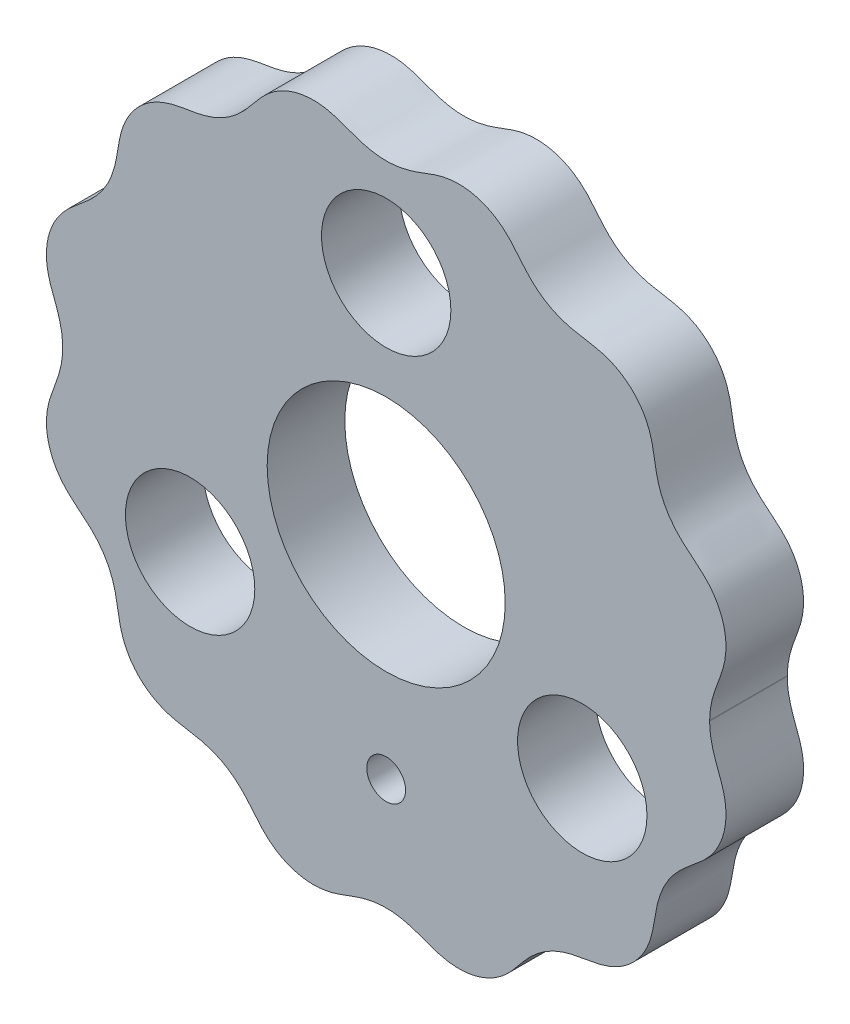
ISO-10303-21;
HEADER;
FILE_DESCRIPTION(('STEP AP214'),'2;1');
FILE_NAME('part.step','',(''),(''),'','','');
FILE_SCHEMA(('AUTOMOTIVE_DESIGN { 1 0 10303 214 1 1 1 1 }'));
ENDSEC;
DATA;
#1=APPLICATION_CONTEXT('core data for automotive mechanical design processes');
#2=APPLICATION_PROTOCOL_DEFINITION('international standard','automotive_design',2000,#1);
#3=PRODUCT_CONTEXT('',#1,'mechanical');
#4=PRODUCT('Part','Part','',(#3));
#5=PRODUCT_RELATED_PRODUCT_CATEGORY('part','',(#4));
#6=PRODUCT_DEFINITION_FORMATION('','',#4);
#7=PRODUCT_DEFINITION_CONTEXT('part definition',#1,'design');
#8=PRODUCT_DEFINITION('design','',#6,#7);
#9=PRODUCT_DEFINITION_SHAPE('','',#8);
#10=(LENGTH_UNIT() NAMED_UNIT(*) SI_UNIT(.MILLI.,.METRE.));
#11=(NAMED_UNIT(*) PLANE_ANGLE_UNIT() SI_UNIT($,.RADIAN.));
#12=(NAMED_UNIT(*) SI_UNIT($,.STERADIAN.) SOLID_ANGLE_UNIT());
#13=UNCERTAINTY_MEASURE_WITH_UNIT(LENGTH_MEASURE(1.E-05),#10,'distance_accuracy_value','');
#14=(GEOMETRIC_REPRESENTATION_CONTEXT(3) GLOBAL_UNCERTAINTY_ASSIGNED_CONTEXT((#13)) GLOBAL_UNIT_ASSIGNED_CONTEXT((#10,
#11,#12)) REPRESENTATION_CONTEXT('',''));
#15=CARTESIAN_POINT('',(0.,0.,0.));
#16=DIRECTION('',(0.,0.,1.));
#17=DIRECTION('',(1.,0.,0.));
#18=AXIS2_PLACEMENT_3D('',#15,#16,#17);
#19=CARTESIAN_POINT('',(-25.0000232097076,-0.0248577986676224,6.));
#20=DIRECTION('',(0.,0.,-1.));
#21=DIRECTION('',(-1.,0.,0.));
#22=AXIS2_PLACEMENT_3D('',#19,#20,#21);
#23=PLANE('',#22);
#24=CARTESIAN_POINT('',(0.,-16.3832589133777,6.));
#25=DIRECTION('',(0.,0.,-1.));
#26=DIRECTION('',(-1.,0.,0.));
#27=AXIS2_PLACEMENT_3D('',#24,#25,#26);
#28=CIRCLE('',#27,1.5);
#29=CARTESIAN_POINT('',(-1.5,-16.3832589133777,6.));
#30=VERTEX_POINT('',#29);
#31=EDGE_CURVE('E149',#30,#30,#28,.T.);
#32=ORIENTED_EDGE('',*,*,#31,.T.);
#33=EDGE_LOOP('',(#32));
#34=FACE_BOUND('',#33,.T.);
#35=CARTESIAN_POINT('',(25.,0.,6.));
#36=CARTESIAN_POINT('',(25.0002031752634,0.049701947483604,6.));
#37=B_SPLINE_CURVE_WITH_KNOTS('',1,(#35,#36),.UNSPECIFIED.,.F.,.F.,(2,2),(0.,1.),.UNSPECIFIED.);
#38=CARTESIAN_POINT('',(25.,0.,6.));
#39=VERTEX_POINT('',#38);
#40=CARTESIAN_POINT('',(25.0002031752634,0.049701947483604,6.));
#41=VERTEX_POINT('',#40);
#42=EDGE_CURVE('E78',#39,#41,#37,.T.);
#43=ORIENTED_EDGE('',*,*,#42,.T.);
#44=CARTESIAN_POINT('',(25.0002031752634,0.049701947483604,6.));
#45=CARTESIAN_POINT('',(25.0004308029821,0.0775440355542,6.));
#46=CARTESIAN_POINT('',(25.0013589498389,0.133217808747836,6.));
#47=CARTESIAN_POINT('',(25.0052678853576,0.264321242683308,6.));
#48=CARTESIAN_POINT('',(25.0169608644288,0.48250430067262,6.));
#49=CARTESIAN_POINT('',(25.0385059182462,0.70465122014413,6.));
#50=CARTESIAN_POINT('',(25.0741191224221,0.965148365334424,6.));
#51=CARTESIAN_POINT('',(25.1202578992177,1.224415288328,6.));
#52=CARTESIAN_POINT('',(25.1763613388595,1.48087377439008,6.));
#53=CARTESIAN_POINT('',(25.2417218488057,1.73543576113443,6.));
#54=CARTESIAN_POINT('',(25.3338607648862,2.05070631367887,6.));
#55=CARTESIAN_POINT('',(25.458833671547,2.42450299248366,6.));
#56=CARTESIAN_POINT('',(25.619629464377,2.8553270127947,6.));
#57=CARTESIAN_POINT('',(25.807904949584,3.34569526181193,6.));
#58=CARTESIAN_POINT('',(25.9672323912442,3.80231614672646,6.));
#59=CARTESIAN_POINT('',(26.0881089968424,4.22663091276651,6.));
#60=CARTESIAN_POINT('',(26.1914394354639,4.70429623522627,6.));
#61=CARTESIAN_POINT('',(26.284792989899,5.41228832652757,6.));
#62=CARTESIAN_POINT('',(26.262511443744,6.4138480406696,6.));
#63=CARTESIAN_POINT('',(25.9409426877914,7.66207714145739,6.));
#64=CARTESIAN_POINT('',(25.2467966467963,8.85795173550189,6.));
#65=CARTESIAN_POINT('',(24.3436846993853,9.76955190457595,6.));
#66=CARTESIAN_POINT('',(23.4156486044098,10.484119509653,6.));
#67=CARTESIAN_POINT('',(22.6100709293762,11.1924733788569,6.));
#68=CARTESIAN_POINT('',(21.9154014187569,12.0128419880505,6.));
#69=CARTESIAN_POINT('',(21.3746687710916,12.943487437276,6.));
#70=CARTESIAN_POINT('',(21.0065603301337,13.9534869995405,6.));
#71=CARTESIAN_POINT('',(20.7917871154137,15.0047427288731,6.));
#72=CARTESIAN_POINT('',(20.6379047111279,16.1656909527777,6.));
#73=CARTESIAN_POINT('',(20.3071808169387,17.4054038528733,6.));
#74=CARTESIAN_POINT('',(19.6220896229016,18.6152349308986,6.));
#75=CARTESIAN_POINT('',(18.6971203126412,19.5302350604708,6.));
#76=CARTESIAN_POINT('',(17.7515763341302,20.1059414667156,6.));
#77=CARTESIAN_POINT('',(16.8189538381598,20.4660073005702,6.));
#78=CARTESIAN_POINT('',(15.9373402603937,20.6681171818277,6.));
#79=CARTESIAN_POINT('',(14.959093015374,20.799215780305,6.));
#80=CARTESIAN_POINT('',(13.9050809626805,21.0193307012289,6.));
#81=CARTESIAN_POINT('',(12.8989692163994,21.396054985324,6.));
#82=CARTESIAN_POINT('',(11.9779735266036,21.9410220374457,6.));
#83=CARTESIAN_POINT('',(11.1701057373892,22.6339793210062,6.));
#84=CARTESIAN_POINT('',(10.4740707739569,23.4291515649925,6.));
#85=CARTESIAN_POINT('',(9.77041704815124,24.3410303174548,6.));
#86=CARTESIAN_POINT('',(8.87788026677586,25.227310888559,6.));
#87=CARTESIAN_POINT('',(7.7020486010681,25.9226038117715,6.));
#88=CARTESIAN_POINT('',(6.29085555988615,26.3006923266119,6.));
#89=CARTESIAN_POINT('',(4.92490938273092,26.2863966030001,6.));
#90=CARTESIAN_POINT('',(3.70882720506166,25.9650638122916,6.));
#91=CARTESIAN_POINT('',(2.64351018252455,25.5271727519968,6.));
#92=CARTESIAN_POINT('',(1.64312745783005,25.1865822256271,6.));
#93=CARTESIAN_POINT('',(0.597006536244666,24.9904413030713,6.));
#94=CARTESIAN_POINT('',(-0.47308343493786,24.9790339612736,6.));
#95=CARTESIAN_POINT('',(-1.53275588650047,25.1558825059455,6.));
#96=CARTESIAN_POINT('',(-2.55560207970244,25.492296977168,6.));
#97=CARTESIAN_POINT('',(-3.46833934497676,25.8678840012778,6.));
#98=CARTESIAN_POINT('',(-4.33290584530746,26.133623194386,6.));
#99=CARTESIAN_POINT('',(-5.32062141951383,26.2880601849475,6.));
#100=CARTESIAN_POINT('',(-6.42733790436494,26.2621973319436,6.));
#101=CARTESIAN_POINT('',(-7.6858688459378,25.932204762174,6.));
#102=CARTESIAN_POINT('',(-8.88405221815833,25.2269417218865,6.));
#103=CARTESIAN_POINT('',(-9.79028218155391,24.3186406944825,6.));
#104=CARTESIAN_POINT('',(-10.5040082869553,23.3901624390499,6.));
#105=CARTESIAN_POINT('',(-11.2156781347917,22.5871666195559,6.));
#106=CARTESIAN_POINT('',(-12.0394746157634,21.8965551364855,6.));
#107=CARTESIAN_POINT('',(-12.9731479381141,21.3610262292244,6.));
#108=CARTESIAN_POINT('',(-13.9848871216895,20.9979048824743,6.));
#109=CARTESIAN_POINT('',(-15.0368297566396,20.7873447689302,6.));
#110=CARTESIAN_POINT('',(-16.1976222288373,20.6324003972841,6.));
#111=CARTESIAN_POINT('',(-17.43583942896,20.2946140334418,6.));
#112=CARTESIAN_POINT('',(-18.4836718031551,19.6922779132858,6.));
#113=CARTESIAN_POINT('',(-19.3001496260399,18.9287579936141,6.));
#114=CARTESIAN_POINT('',(-19.9569019400926,18.0284413485263,6.));
#115=CARTESIAN_POINT('',(-20.3956228737666,17.1161104301816,6.));
#116=CARTESIAN_POINT('',(-20.6530452676583,16.0602863357028,6.));
#117=CARTESIAN_POINT('',(-20.8061351462569,14.9146022110265,6.));
#118=CARTESIAN_POINT('',(-21.0267189246062,13.8865221765981,6.));
#119=CARTESIAN_POINT('',(-21.3977475752367,12.8977489520371,6.));
#120=CARTESIAN_POINT('',(-21.9368965677596,11.9842924543769,6.));
#121=CARTESIAN_POINT('',(-22.6269932301173,11.176369600017,6.));
#122=CARTESIAN_POINT('',(-23.4270223990997,10.4755785196582,6.));
#123=CARTESIAN_POINT('',(-24.3450438403366,9.76755733882921,6.));
#124=CARTESIAN_POINT('',(-25.2377013940964,8.86663734596778,6.));
#125=CARTESIAN_POINT('',(-25.9335644549066,7.67844164741142,6.));
#126=CARTESIAN_POINT('',(-26.2610931106782,6.43001326971601,6.));
#127=CARTESIAN_POINT('',(-26.2885152218496,5.32858356774412,6.));
#128=CARTESIAN_POINT('',(-26.1354550635467,4.34059115997797,6.));
#129=CARTESIAN_POINT('',(-25.8707364066922,3.47572040001724,6.));
#130=CARTESIAN_POINT('',(-25.4952059309911,2.56292781452694,6.));
#131=CARTESIAN_POINT('',(-25.157831342755,1.54045458684821,6.));
#132=CARTESIAN_POINT('',(-24.9796766478588,0.481005827793855,6.));
#133=CARTESIAN_POINT('',(-24.9896445598273,-0.589100982082312,6.));
#134=CARTESIAN_POINT('',(-25.1845260720633,-1.63546137962552,6.));
#135=CARTESIAN_POINT('',(-25.5242140207482,-2.63620601322623,6.));
#136=CARTESIAN_POINT('',(-25.9623216597714,-3.70140198241162,6.));
#137=CARTESIAN_POINT('',(-26.285367063799,-4.91697626625228,6.));
#138=CARTESIAN_POINT('',(-26.3016798158474,-6.28291040166162,6.));
#139=CARTESIAN_POINT('',(-25.9257099084613,-7.69466919566292,6.));
#140=CARTESIAN_POINT('',(-25.2321589722124,-8.87151757244903,6.));
#141=CARTESIAN_POINT('',(-24.3471119837177,-9.7653501872607,6.));
#142=CARTESIAN_POINT('',(-23.4353674871062,-10.4692298582723,6.));
#143=CARTESIAN_POINT('',(-22.6395983382936,-11.1645009343387,6.));
#144=CARTESIAN_POINT('',(-21.9456715794189,-11.9715360343762,6.));
#145=CARTESIAN_POINT('',(-21.3994695440305,-12.8917897274263,6.));
#146=CARTESIAN_POINT('',(-21.0214990457729,-13.8974500485877,6.));
#147=CARTESIAN_POINT('',(-20.8003680092921,-14.951283195106,6.));
#148=CARTESIAN_POINT('',(-20.6693257410411,-15.9295422426056,6.));
#149=CARTESIAN_POINT('',(-20.4682601839915,-16.8113528787841,6.));
#150=CARTESIAN_POINT('',(-20.1095054344532,-17.7444909566973,6.));
#151=CARTESIAN_POINT('',(-19.5352250693332,-18.6908790699779,6.));
#152=CARTESIAN_POINT('',(-18.6215891985111,-19.6172341961515,6.));
#153=CARTESIAN_POINT('',(-17.4127951277837,-20.3040962801588,6.));
#154=CARTESIAN_POINT('',(-16.1734934696653,-20.6366044147941,6.));
#155=CARTESIAN_POINT('',(-15.0125428588064,-20.7906810729801,6.));
#156=CARTESIAN_POINT('',(-13.9611505342109,-21.0044479566719,6.));
#157=CARTESIAN_POINT('',(-12.9506870477024,-21.3713236067917,6.));
#158=CARTESIAN_POINT('',(-12.0193496474329,-21.9108020955093,6.));
#159=CARTESIAN_POINT('',(-11.1980708136155,-22.604475082747,6.));
#160=CARTESIAN_POINT('',(-10.4890421759678,-23.4094433121762,6.));
#161=CARTESIAN_POINT('',(-9.77447284204153,-24.337578456278,6.));
#162=CARTESIAN_POINT('',(-8.86453555729236,-25.2419920847794,6.));
#163=CARTESIAN_POINT('',(-7.81941348054743,-25.850368790917,6.));
#164=CARTESIAN_POINT('',(-6.75111843693724,-26.1766735877724,6.));
#165=CARTESIAN_POINT('',(-5.82719566616261,-26.2778400488724,6.));
#166=CARTESIAN_POINT('',(-5.08414189054617,-26.2552250846514,6.));
#167=CARTESIAN_POINT('',(-4.27435701235898,-26.1193555304735,6.));
#168=CARTESIAN_POINT('',(-3.41922910418536,-25.84785235,6.));
#169=CARTESIAN_POINT('',(-2.52044947063853,-25.4794613328657,6.));
#170=CARTESIAN_POINT('',(-1.52096638794575,-25.1546359371525,6.));
#171=CARTESIAN_POINT('',(-0.478930933339679,-24.9807134806625,6.));
#172=CARTESIAN_POINT('',(0.581426655581783,-24.9891026430057,6.));
#173=CARTESIAN_POINT('',(1.62667227001988,-25.1817505783671,6.));
#174=CARTESIAN_POINT('',(2.63367400387672,-25.5229674346919,6.));
#175=CARTESIAN_POINT('',(3.70611560055771,-25.9645833223633,6.));
#176=CARTESIAN_POINT('',(4.9315827981852,-26.2884722321436,6.));
#177=CARTESIAN_POINT('',(6.30933785562294,-26.2998640826,6.));
#178=CARTESIAN_POINT('',(7.731407453562,-25.9116598464267,6.));
#179=CARTESIAN_POINT('',(8.91250207436252,-25.202295012769,6.));
#180=CARTESIAN_POINT('',(9.80386463625248,-24.3011583322881,6.));
#181=CARTESIAN_POINT('',(10.5105104864333,-23.3823768913158,6.));
#182=CARTESIAN_POINT('',(11.2172632854706,-22.586282659155,6.));
#183=CARTESIAN_POINT('',(12.2371189102909,-21.7311243612219,6.));
#184=CARTESIAN_POINT('',(13.4394027619243,-21.125853099715,6.));
#185=CARTESIAN_POINT('',(14.7399499082291,-20.8265445235791,6.));
#186=CARTESIAN_POINT('',(16.1514869182664,-20.6399940454572,6.));
#187=CARTESIAN_POINT('',(17.377311503242,-20.3162532662721,6.));
#188=CARTESIAN_POINT('',(18.5781785299062,-19.6481673968653,6.));
#189=CARTESIAN_POINT('',(19.6200814178526,-18.6143671567186,6.));
#190=CARTESIAN_POINT('',(20.2957900238015,-17.4235772032078,6.));
#191=CARTESIAN_POINT('',(20.6292296768879,-16.2106156715508,6.));
#192=CARTESIAN_POINT('',(20.7831522177232,-15.0690546129471,6.));
#193=CARTESIAN_POINT('',(20.9864743382032,-14.0322166930284,6.));
#194=CARTESIAN_POINT('',(21.3370872274826,-13.0271415620461,6.));
#195=CARTESIAN_POINT('',(21.8597723823047,-12.0935327250146,6.));
#196=CARTESIAN_POINT('',(22.5404514437567,-11.2620272553952,6.));
#197=CARTESIAN_POINT('',(23.2420347985814,-10.6335048558452,6.));
#198=CARTESIAN_POINT('',(23.8729241339272,-10.1328677537652,6.));
#199=CARTESIAN_POINT('',(24.559448753872,-9.54877519107727,6.));
#200=CARTESIAN_POINT('',(25.2509330394033,-8.82402404509227,6.));
#201=CARTESIAN_POINT('',(25.9005904677268,-7.75892757333974,6.));
#202=CARTESIAN_POINT('',(26.2488657418611,-6.509268079248,6.));
#203=CARTESIAN_POINT('',(26.2930130200272,-5.40057761661743,6.));
#204=CARTESIAN_POINT('',(26.1690820375023,-4.53635291845614,6.));
#205=CARTESIAN_POINT('',(26.0074616040383,-3.91960884313096,6.));
#206=CARTESIAN_POINT('',(25.837320411901,-3.42880771729377,6.));
#207=CARTESIAN_POINT('',(25.6953068903752,-3.05245073395512,6.));
#208=CARTESIAN_POINT('',(25.5527913461473,-2.67635693700375,6.));
#209=CARTESIAN_POINT('',(25.4376716689992,-2.36153219436734,6.));
#210=CARTESIAN_POINT('',(25.3314608199182,-2.04352586761472,6.));
#211=CARTESIAN_POINT('',(25.2378541604417,-1.72161835014221,6.));
#212=CARTESIAN_POINT('',(25.171720803957,-1.46161952055921,6.));
#213=CARTESIAN_POINT('',(25.1223483923538,-1.23240945162302,6.));
#214=CARTESIAN_POINT('',(25.0865613114723,-1.03418524112176,6.));
#215=CARTESIAN_POINT('',(25.0612710998726,-0.868216065282799,6.));
#216=CARTESIAN_POINT('',(25.0438194556348,-0.735775061628619,6.));
#217=CARTESIAN_POINT('',(25.029199756153,-0.604110594252171,6.));
#218=CARTESIAN_POINT('',(25.0174542164086,-0.47109542641549,6.));
#219=CARTESIAN_POINT('',(25.0086162023709,-0.331732724347816,6.));
#220=CARTESIAN_POINT('',(25.0027105168058,-0.186096381179884,6.));
#221=CARTESIAN_POINT('',(25.0004928213622,-0.0852400906421702,6.));
#222=CARTESIAN_POINT('',(25.,-0.0284193788179223,6.));
#223=CARTESIAN_POINT('',(25.,0.,6.));
#224=B_SPLINE_CURVE_WITH_KNOTS('',4,(#44,#45,#46,#47,#48,#49,#50,#51,#52,#53,#54,#55,#56,#57,
#58,#59,#60,#61,#62,#63,#64,#65,#66,#67,#68,#69,#70,#71,#72,#73,#74,#75,#76,#77,#78,#79,#80,#81,
#82,#83,#84,#85,#86,#87,#88,#89,#90,#91,#92,#93,#94,#95,#96,#97,#98,#99,#100,#101,#102,#103,
#104,#105,#106,#107,#108,#109,#110,#111,#112,#113,#114,#115,#116,#117,#118,#119,#120,#121,#122,
#123,#124,#125,#126,#127,#128,#129,#130,#131,#132,#133,#134,#135,#136,#137,#138,#139,#140,#141,
#142,#143,#144,#145,#146,#147,#148,#149,#150,#151,#152,#153,#154,#155,#156,#157,#158,#159,#160,
#161,#162,#163,#164,#165,#166,#167,#168,#169,#170,#171,#172,#173,#174,#175,#176,#177,#178,#179,
#180,#181,#182,#183,#184,#185,#186,#187,#188,#189,#190,#191,#192,#193,#194,#195,#196,#197,#198,
#199,#200,#201,#202,#203,#204,#205,#206,#207,#208,#209,#210,#211,#212,#213,#214,#215,#216,#217,
#218,#219,#220,#221,#222,#223),.UNSPECIFIED.,.F.,.F.,(5,1,1,1,1,1,1,1,1,1,1,1,1,1,1,1,1,1,1,1,1,
1,1,1,1,1,1,1,1,1,1,1,1,1,1,1,1,1,1,1,1,1,1,1,1,1,1,1,1,1,1,1,1,1,1,1,1,1,1,1,1,1,1,1,1,1,1,1,1,
1,1,1,1,1,1,1,1,1,1,1,1,1,1,1,1,1,1,1,1,1,1,1,1,1,1,1,1,1,1,1,1,1,1,1,1,1,1,1,1,1,1,1,1,1,1,1,1,
1,1,1,1,1,1,1,1,1,1,1,1,1,1,1,1,1,1,1,1,1,1,1,1,1,1,1,1,1,1,1,1,1,1,1,1,1,1,1,1,1,1,1,1,1,1,1,1,
1,1,1,1,1,1,1,1,1,1,1,5),(0.076056741224296,0.0767032430807499,0.0773497449372037,
0.0786427486501113,0.0799357523630191,0.0812287560759267,0.0825217597888343,0.0838147635017421,
0.0851077672146497,0.0864007709275574,0.0889867783533726,0.0915727857791879,0.0941587932050032,
0.0967448006308186,0.0985007915024587,0.100256782374099,0.103768764117379,0.110792727603939,
0.118067133542496,0.125341539481052,0.130608789150605,0.135876038820157,0.14114328848971,
0.146410538159263,0.151677938280411,0.156945338401558,0.162212738522706,0.167480138643854,
0.17475444919313,0.182028759742406,0.189202389683609,0.19278920465421,0.196376019624811,
0.201662085573225,0.206948151521639,0.212234217470054,0.217520283418468,0.222711529408791,
0.227902775399113,0.233094021389436,0.238285267379759,0.245396057411596,0.252506847443432,
0.25961763704314,0.266728426642848,0.271919673352958,0.277110920063068,0.282302166773178,
0.287493413483288,0.292779478785207,0.298065544087125,0.303351609389044,0.308637674690962,
0.312224489789328,0.315811304887694,0.322984935084426,0.330259244772781,0.337533554461136,
0.342800955850064,0.348068357238992,0.35333575862792,0.358603160016848,0.363870408432517,
0.369137656848186,0.374404905263855,0.379672153679524,0.386946560388489,0.394220967097453,
0.397870663794444,0.401520360491435,0.408819753885416,0.413980021549147,0.419140289212877,
0.424300556876608,0.429460824540339,0.434683500631276,0.439906176722214,0.445128852813151,
0.450351528904089,0.457525310338322,0.464699091772555,0.471872729369557,0.475459548168057,
0.479046366966558,0.484332412026855,0.489618457087151,0.494904502147448,0.500190547207745,
0.505381816299789,0.510573085391834,0.515764354483879,0.520955623575924,0.528066400784513,
0.535177177993102,0.542287980452911,0.549398782912721,0.55459001012343,0.55978123733414,
0.564972464544849,0.570163691755558,0.575449774413493,0.580735857071427,0.586021939729361,
0.591308022387296,0.594894833721025,0.598481645054755,0.605655267722214,0.612929602678809,
0.620203937635403,0.625471300920329,0.630738664205255,0.636006027490181,0.641273390775106,
0.646540676982264,0.651807963189421,0.657075249396579,0.662342535603736,0.669616919079574,
0.676891302555411,0.680541003354389,0.684190704153367,0.687840404952345,0.691490105751323,
0.696650344501852,0.701810583252381,0.70697082200291,0.712131060753439,0.717353769498491,
0.722576478243542,0.727799186988594,0.733021895733645,0.740195659422101,0.747369423110557,
0.754543079197019,0.761716735283481,0.766939688474984,0.772162641666487,0.77738559485799,
0.782608548049494,0.793054366573087,0.798277275834884,0.803500185096681,0.810673859356344,
0.817847533616006,0.82495834896025,0.832069164304494,0.837260376321381,0.842451588338268,
0.847642800355155,0.852834012372042,0.858120108152312,0.863406203932583,0.868692299712854,
0.871335347602989,0.873978395493125,0.881152010777547,0.888325626061968,0.895576470841295,
0.899201893230958,0.902827315620621,0.905466854307957,0.908106392995292,0.90942616233896,
0.910745931682628,0.913385470369964,0.914705239713632,0.9160250090573,0.917344778400968,
0.918664547744636,0.91932443241647,0.919984317088304,0.920644201760138,0.921304086431972,
0.921963971103806,0.92262385577564,0.923283740447474,0.923943625119308),.UNSPECIFIED.);
#225=EDGE_CURVE('E62',#41,#39,#224,.T.);
#226=ORIENTED_EDGE('',*,*,#225,.T.);
#227=EDGE_LOOP('',(#43,#226));
#228=FACE_BOUND('',#227,.T.);
#229=CARTESIAN_POINT('',(0.,0.,6.));
#230=DIRECTION('',(0.,0.,1.));
#231=DIRECTION('',(1.,0.,0.));
#232=AXIS2_PLACEMENT_3D('',#229,#230,#231);
#233=CIRCLE('',#232,9.2);
#234=CARTESIAN_POINT('',(9.2,0.,6.));
#235=VERTEX_POINT('',#234);
#236=EDGE_CURVE('E86',#235,#235,#233,.T.);
#237=ORIENTED_EDGE('',*,*,#236,.F.);
#238=EDGE_LOOP('',(#237));
#239=FACE_BOUND('',#238,.T.);
#240=CARTESIAN_POINT('',(0.,17.5,6.));
#241=DIRECTION('',(0.,0.,1.));
#242=DIRECTION('',(1.,0.,0.));
#243=AXIS2_PLACEMENT_3D('',#240,#241,#242);
#244=CIRCLE('',#243,5.);
#245=CARTESIAN_POINT('',(5.,17.5,6.));
#246=VERTEX_POINT('',#245);
#247=EDGE_CURVE('E172',#246,#246,#244,.T.);
#248=ORIENTED_EDGE('',*,*,#247,.F.);
#249=EDGE_LOOP('',(#248));
#250=FACE_BOUND('',#249,.T.);
#251=CARTESIAN_POINT('',(15.1554445662277,-8.75,6.));
#252=DIRECTION('',(0.,0.,1.));
#253=DIRECTION('',(1.,0.,0.));
#254=AXIS2_PLACEMENT_3D('',#251,#252,#253);
#255=CIRCLE('',#254,5.);
#256=CARTESIAN_POINT('',(20.1554445662277,-8.75,6.));
#257=VERTEX_POINT('',#256);
#258=EDGE_CURVE('E164',#257,#257,#255,.T.);
#259=ORIENTED_EDGE('',*,*,#258,.F.);
#260=EDGE_LOOP('',(#259));
#261=FACE_BOUND('',#260,.T.);
#262=CARTESIAN_POINT('',(-15.1554445662277,-8.75000000000001,6.));
#263=DIRECTION('',(0.,0.,1.));
#264=DIRECTION('',(1.,0.,0.));
#265=AXIS2_PLACEMENT_3D('',#262,#263,#264);
#266=CIRCLE('',#265,5.);
#267=CARTESIAN_POINT('',(-10.1554445662277,-8.75000000000001,6.));
#268=VERTEX_POINT('',#267);
#269=EDGE_CURVE('E156',#268,#268,#266,.T.);
#270=ORIENTED_EDGE('',*,*,#269,.F.);
#271=EDGE_LOOP('',(#270));
#272=FACE_BOUND('',#271,.T.);
#273=ADVANCED_FACE('F45',(#34,#228,#239,#250,#261,#272),#23,.F.);
#274=CARTESIAN_POINT('',(-25.0000232097076,-0.0248577986676224,0.));
#275=DIRECTION('',(0.,0.,-1.));
#276=DIRECTION('',(-1.,0.,0.));
#277=AXIS2_PLACEMENT_3D('',#274,#275,#276);
#278=PLANE('',#277);
#279=CARTESIAN_POINT('',(0.,-16.3832589133777,0.));
#280=DIRECTION('',(0.,0.,1.));
#281=DIRECTION('',(1.,0.,0.));
#282=AXIS2_PLACEMENT_3D('',#279,#280,#281);
#283=CIRCLE('',#282,1.5);
#284=CARTESIAN_POINT('',(1.5,-16.3832589133777,0.));
#285=VERTEX_POINT('',#284);
#286=EDGE_CURVE('E146',#285,#285,#283,.T.);
#287=ORIENTED_EDGE('',*,*,#286,.T.);
#288=EDGE_LOOP('',(#287));
#289=FACE_BOUND('',#288,.T.);
#290=CARTESIAN_POINT('',(15.1554445662277,-8.75,0.));
#291=DIRECTION('',(0.,0.,1.));
#292=DIRECTION('',(1.,0.,0.));
#293=AXIS2_PLACEMENT_3D('',#290,#291,#292);
#294=CIRCLE('',#293,5.);
#295=CARTESIAN_POINT('',(20.1554445662277,-8.75,0.));
#296=VERTEX_POINT('',#295);
#297=EDGE_CURVE('E162',#296,#296,#294,.T.);
#298=ORIENTED_EDGE('',*,*,#297,.T.);
#299=EDGE_LOOP('',(#298));
#300=FACE_BOUND('',#299,.T.);
#301=CARTESIAN_POINT('',(0.,0.,0.));
#302=DIRECTION('',(0.,0.,1.));
#303=DIRECTION('',(1.,0.,0.));
#304=AXIS2_PLACEMENT_3D('',#301,#302,#303);
#305=CIRCLE('',#304,9.2);
#306=CARTESIAN_POINT('',(9.2,0.,0.));
#307=VERTEX_POINT('',#306);
#308=EDGE_CURVE('E90',#307,#307,#305,.T.);
#309=ORIENTED_EDGE('',*,*,#308,.T.);
#310=EDGE_LOOP('',(#309));
#311=FACE_BOUND('',#310,.T.);
#312=CARTESIAN_POINT('',(25.,0.,0.));
#313=CARTESIAN_POINT('',(25.0002031752634,0.049701947483604,0.));
#314=B_SPLINE_CURVE_WITH_KNOTS('',1,(#312,#313),.UNSPECIFIED.,.F.,.F.,(2,2),(0.,1.),.UNSPECIFIED.);
#315=CARTESIAN_POINT('',(25.,0.,0.));
#316=VERTEX_POINT('',#315);
#317=CARTESIAN_POINT('',(25.0002031752634,0.049701947483604,0.));
#318=VERTEX_POINT('',#317);
#319=EDGE_CURVE('E79',#316,#318,#314,.T.);
#320=ORIENTED_EDGE('',*,*,#319,.F.);
#321=CARTESIAN_POINT('',(25.0002031752634,0.049701947483604,0.));
#322=CARTESIAN_POINT('',(25.0004308029821,0.0775440355542,0.));
#323=CARTESIAN_POINT('',(25.0013589498389,0.133217808747836,0.));
#324=CARTESIAN_POINT('',(25.0052678853576,0.264321242683308,0.));
#325=CARTESIAN_POINT('',(25.0169608644288,0.48250430067262,0.));
#326=CARTESIAN_POINT('',(25.0385059182462,0.70465122014413,0.));
#327=CARTESIAN_POINT('',(25.0741191224221,0.965148365334424,0.));
#328=CARTESIAN_POINT('',(25.1202578992177,1.224415288328,0.));
#329=CARTESIAN_POINT('',(25.1763613388595,1.48087377439008,0.));
#330=CARTESIAN_POINT('',(25.2417218488057,1.73543576113443,0.));
#331=CARTESIAN_POINT('',(25.3338607648862,2.05070631367887,0.));
#332=CARTESIAN_POINT('',(25.458833671547,2.42450299248366,0.));
#333=CARTESIAN_POINT('',(25.619629464377,2.8553270127947,0.));
#334=CARTESIAN_POINT('',(25.807904949584,3.34569526181193,0.));
#335=CARTESIAN_POINT('',(25.9672323912442,3.80231614672646,0.));
#336=CARTESIAN_POINT('',(26.0881089968424,4.22663091276651,0.));
#337=CARTESIAN_POINT('',(26.1914394354639,4.70429623522627,0.));
#338=CARTESIAN_POINT('',(26.284792989899,5.41228832652757,0.));
#339=CARTESIAN_POINT('',(26.262511443744,6.4138480406696,0.));
#340=CARTESIAN_POINT('',(25.9409426877914,7.66207714145739,0.));
#341=CARTESIAN_POINT('',(25.2467966467963,8.85795173550189,0.));
#342=CARTESIAN_POINT('',(24.3436846993853,9.76955190457595,0.));
#343=CARTESIAN_POINT('',(23.4156486044098,10.484119509653,0.));
#344=CARTESIAN_POINT('',(22.6100709293762,11.1924733788569,0.));
#345=CARTESIAN_POINT('',(21.9154014187569,12.0128419880505,0.));
#346=CARTESIAN_POINT('',(21.3746687710916,12.943487437276,0.));
#347=CARTESIAN_POINT('',(21.0065603301337,13.9534869995405,0.));
#348=CARTESIAN_POINT('',(20.7917871154137,15.0047427288731,0.));
#349=CARTESIAN_POINT('',(20.6379047111279,16.1656909527777,0.));
#350=CARTESIAN_POINT('',(20.3071808169387,17.4054038528733,0.));
#351=CARTESIAN_POINT('',(19.6220896229016,18.6152349308986,0.));
#352=CARTESIAN_POINT('',(18.6971203126412,19.5302350604708,0.));
#353=CARTESIAN_POINT('',(17.7515763341302,20.1059414667156,0.));
#354=CARTESIAN_POINT('',(16.8189538381598,20.4660073005702,0.));
#355=CARTESIAN_POINT('',(15.9373402603937,20.6681171818277,0.));
#356=CARTESIAN_POINT('',(14.959093015374,20.799215780305,0.));
#357=CARTESIAN_POINT('',(13.9050809626805,21.0193307012289,0.));
#358=CARTESIAN_POINT('',(12.8989692163994,21.396054985324,0.));
#359=CARTESIAN_POINT('',(11.9779735266036,21.9410220374457,0.));
#360=CARTESIAN_POINT('',(11.1701057373892,22.6339793210062,0.));
#361=CARTESIAN_POINT('',(10.4740707739569,23.4291515649925,0.));
#362=CARTESIAN_POINT('',(9.77041704815124,24.3410303174548,0.));
#363=CARTESIAN_POINT('',(8.87788026677586,25.227310888559,0.));
#364=CARTESIAN_POINT('',(7.7020486010681,25.9226038117715,0.));
#365=CARTESIAN_POINT('',(6.29085555988615,26.3006923266119,0.));
#366=CARTESIAN_POINT('',(4.92490938273092,26.2863966030001,0.));
#367=CARTESIAN_POINT('',(3.70882720506166,25.9650638122916,0.));
#368=CARTESIAN_POINT('',(2.64351018252455,25.5271727519968,0.));
#369=CARTESIAN_POINT('',(1.64312745783005,25.1865822256271,0.));
#370=CARTESIAN_POINT('',(0.597006536244666,24.9904413030713,0.));
#371=CARTESIAN_POINT('',(-0.47308343493786,24.9790339612736,0.));
#372=CARTESIAN_POINT('',(-1.53275588650047,25.1558825059455,0.));
#373=CARTESIAN_POINT('',(-2.55560207970244,25.492296977168,0.));
#374=CARTESIAN_POINT('',(-3.46833934497676,25.8678840012778,0.));
#375=CARTESIAN_POINT('',(-4.33290584530746,26.133623194386,0.));
#376=CARTESIAN_POINT('',(-5.32062141951383,26.2880601849475,0.));
#377=CARTESIAN_POINT('',(-6.42733790436494,26.2621973319436,0.));
#378=CARTESIAN_POINT('',(-7.6858688459378,25.932204762174,0.));
#379=CARTESIAN_POINT('',(-8.88405221815833,25.2269417218865,0.));
#380=CARTESIAN_POINT('',(-9.79028218155391,24.3186406944825,0.));
#381=CARTESIAN_POINT('',(-10.5040082869553,23.3901624390499,0.));
#382=CARTESIAN_POINT('',(-11.2156781347917,22.5871666195559,0.));
#383=CARTESIAN_POINT('',(-12.0394746157634,21.8965551364855,0.));
#384=CARTESIAN_POINT('',(-12.9731479381141,21.3610262292244,0.));
#385=CARTESIAN_POINT('',(-13.9848871216895,20.9979048824743,0.));
#386=CARTESIAN_POINT('',(-15.0368297566396,20.7873447689302,0.));
#387=CARTESIAN_POINT('',(-16.1976222288373,20.6324003972841,0.));
#388=CARTESIAN_POINT('',(-17.43583942896,20.2946140334418,0.));
#389=CARTESIAN_POINT('',(-18.4836718031551,19.6922779132858,0.));
#390=CARTESIAN_POINT('',(-19.3001496260399,18.9287579936141,0.));
#391=CARTESIAN_POINT('',(-19.9569019400926,18.0284413485263,0.));
#392=CARTESIAN_POINT('',(-20.3956228737666,17.1161104301816,0.));
#393=CARTESIAN_POINT('',(-20.6530452676583,16.0602863357028,0.));
#394=CARTESIAN_POINT('',(-20.8061351462569,14.9146022110265,0.));
#395=CARTESIAN_POINT('',(-21.0267189246062,13.8865221765981,0.));
#396=CARTESIAN_POINT('',(-21.3977475752367,12.8977489520371,0.));
#397=CARTESIAN_POINT('',(-21.9368965677596,11.9842924543769,0.));
#398=CARTESIAN_POINT('',(-22.6269932301173,11.176369600017,0.));
#399=CARTESIAN_POINT('',(-23.4270223990997,10.4755785196582,0.));
#400=CARTESIAN_POINT('',(-24.3450438403366,9.76755733882921,0.));
#401=CARTESIAN_POINT('',(-25.2377013940964,8.86663734596778,0.));
#402=CARTESIAN_POINT('',(-25.9335644549066,7.67844164741142,0.));
#403=CARTESIAN_POINT('',(-26.2610931106782,6.43001326971601,0.));
#404=CARTESIAN_POINT('',(-26.2885152218496,5.32858356774412,0.));
#405=CARTESIAN_POINT('',(-26.1354550635467,4.34059115997797,0.));
#406=CARTESIAN_POINT('',(-25.8707364066922,3.47572040001724,0.));
#407=CARTESIAN_POINT('',(-25.4952059309911,2.56292781452694,0.));
#408=CARTESIAN_POINT('',(-25.157831342755,1.54045458684821,0.));
#409=CARTESIAN_POINT('',(-24.9796766478588,0.481005827793855,0.));
#410=CARTESIAN_POINT('',(-24.9896445598273,-0.589100982082312,0.));
#411=CARTESIAN_POINT('',(-25.1845260720633,-1.63546137962552,0.));
#412=CARTESIAN_POINT('',(-25.5242140207482,-2.63620601322623,0.));
#413=CARTESIAN_POINT('',(-25.9623216597714,-3.70140198241162,0.));
#414=CARTESIAN_POINT('',(-26.285367063799,-4.91697626625228,0.));
#415=CARTESIAN_POINT('',(-26.3016798158474,-6.28291040166162,0.));
#416=CARTESIAN_POINT('',(-25.9257099084613,-7.69466919566292,0.));
#417=CARTESIAN_POINT('',(-25.2321589722124,-8.87151757244903,0.));
#418=CARTESIAN_POINT('',(-24.3471119837177,-9.7653501872607,0.));
#419=CARTESIAN_POINT('',(-23.4353674871062,-10.4692298582723,0.));
#420=CARTESIAN_POINT('',(-22.6395983382936,-11.1645009343387,0.));
#421=CARTESIAN_POINT('',(-21.9456715794189,-11.9715360343762,0.));
#422=CARTESIAN_POINT('',(-21.3994695440305,-12.8917897274263,0.));
#423=CARTESIAN_POINT('',(-21.0214990457729,-13.8974500485877,0.));
#424=CARTESIAN_POINT('',(-20.8003680092921,-14.951283195106,0.));
#425=CARTESIAN_POINT('',(-20.6693257410411,-15.9295422426056,0.));
#426=CARTESIAN_POINT('',(-20.4682601839915,-16.8113528787841,0.));
#427=CARTESIAN_POINT('',(-20.1095054344532,-17.7444909566973,0.));
#428=CARTESIAN_POINT('',(-19.5352250693332,-18.6908790699779,0.));
#429=CARTESIAN_POINT('',(-18.6215891985111,-19.6172341961515,0.));
#430=CARTESIAN_POINT('',(-17.4127951277837,-20.3040962801588,0.));
#431=CARTESIAN_POINT('',(-16.1734934696653,-20.6366044147941,0.));
#432=CARTESIAN_POINT('',(-15.0125428588064,-20.7906810729801,0.));
#433=CARTESIAN_POINT('',(-13.9611505342109,-21.0044479566719,0.));
#434=CARTESIAN_POINT('',(-12.9506870477024,-21.3713236067917,0.));
#435=CARTESIAN_POINT('',(-12.0193496474329,-21.9108020955093,0.));
#436=CARTESIAN_POINT('',(-11.1980708136155,-22.604475082747,0.));
#437=CARTESIAN_POINT('',(-10.4890421759678,-23.4094433121762,0.));
#438=CARTESIAN_POINT('',(-9.77447284204153,-24.337578456278,0.));
#439=CARTESIAN_POINT('',(-8.86453555729236,-25.2419920847794,0.));
#440=CARTESIAN_POINT('',(-7.81941348054743,-25.850368790917,0.));
#441=CARTESIAN_POINT('',(-6.75111843693724,-26.1766735877724,0.));
#442=CARTESIAN_POINT('',(-5.82719566616261,-26.2778400488724,0.));
#443=CARTESIAN_POINT('',(-5.08414189054617,-26.2552250846514,0.));
#444=CARTESIAN_POINT('',(-4.27435701235898,-26.1193555304735,0.));
#445=CARTESIAN_POINT('',(-3.41922910418536,-25.84785235,0.));
#446=CARTESIAN_POINT('',(-2.52044947063853,-25.4794613328657,0.));
#447=CARTESIAN_POINT('',(-1.52096638794575,-25.1546359371525,0.));
#448=CARTESIAN_POINT('',(-0.478930933339679,-24.9807134806625,0.));
#449=CARTESIAN_POINT('',(0.581426655581783,-24.9891026430057,0.));
#450=CARTESIAN_POINT('',(1.62667227001988,-25.1817505783671,0.));
#451=CARTESIAN_POINT('',(2.63367400387672,-25.5229674346919,0.));
#452=CARTESIAN_POINT('',(3.70611560055771,-25.9645833223633,0.));
#453=CARTESIAN_POINT('',(4.9315827981852,-26.2884722321436,0.));
#454=CARTESIAN_POINT('',(6.30933785562294,-26.2998640826,0.));
#455=CARTESIAN_POINT('',(7.731407453562,-25.9116598464267,0.));
#456=CARTESIAN_POINT('',(8.91250207436252,-25.202295012769,0.));
#457=CARTESIAN_POINT('',(9.80386463625248,-24.3011583322881,0.));
#458=CARTESIAN_POINT('',(10.5105104864333,-23.3823768913158,0.));
#459=CARTESIAN_POINT('',(11.2172632854706,-22.586282659155,0.));
#460=CARTESIAN_POINT('',(12.2371189102909,-21.7311243612219,0.));
#461=CARTESIAN_POINT('',(13.4394027619243,-21.125853099715,0.));
#462=CARTESIAN_POINT('',(14.7399499082291,-20.8265445235791,0.));
#463=CARTESIAN_POINT('',(16.1514869182664,-20.6399940454572,0.));
#464=CARTESIAN_POINT('',(17.377311503242,-20.3162532662721,0.));
#465=CARTESIAN_POINT('',(18.5781785299062,-19.6481673968653,0.));
#466=CARTESIAN_POINT('',(19.6200814178526,-18.6143671567186,0.));
#467=CARTESIAN_POINT('',(20.2957900238015,-17.4235772032078,0.));
#468=CARTESIAN_POINT('',(20.6292296768879,-16.2106156715508,0.));
#469=CARTESIAN_POINT('',(20.7831522177232,-15.0690546129471,0.));
#470=CARTESIAN_POINT('',(20.9864743382032,-14.0322166930284,0.));
#471=CARTESIAN_POINT('',(21.3370872274826,-13.0271415620461,0.));
#472=CARTESIAN_POINT('',(21.8597723823047,-12.0935327250146,0.));
#473=CARTESIAN_POINT('',(22.5404514437567,-11.2620272553952,0.));
#474=CARTESIAN_POINT('',(23.2420347985814,-10.6335048558452,0.));
#475=CARTESIAN_POINT('',(23.8729241339272,-10.1328677537652,0.));
#476=CARTESIAN_POINT('',(24.559448753872,-9.54877519107727,0.));
#477=CARTESIAN_POINT('',(25.2509330394033,-8.82402404509227,0.));
#478=CARTESIAN_POINT('',(25.9005904677268,-7.75892757333974,0.));
#479=CARTESIAN_POINT('',(26.2488657418611,-6.509268079248,0.));
#480=CARTESIAN_POINT('',(26.2930130200272,-5.40057761661743,0.));
#481=CARTESIAN_POINT('',(26.1690820375023,-4.53635291845614,0.));
#482=CARTESIAN_POINT('',(26.0074616040383,-3.91960884313096,0.));
#483=CARTESIAN_POINT('',(25.837320411901,-3.42880771729377,0.));
#484=CARTESIAN_POINT('',(25.6953068903752,-3.05245073395512,0.));
#485=CARTESIAN_POINT('',(25.5527913461473,-2.67635693700375,0.));
#486=CARTESIAN_POINT('',(25.4376716689992,-2.36153219436734,0.));
#487=CARTESIAN_POINT('',(25.3314608199182,-2.04352586761472,0.));
#488=CARTESIAN_POINT('',(25.2378541604417,-1.72161835014221,0.));
#489=CARTESIAN_POINT('',(25.171720803957,-1.46161952055921,0.));
#490=CARTESIAN_POINT('',(25.1223483923538,-1.23240945162302,0.));
#491=CARTESIAN_POINT('',(25.0865613114723,-1.03418524112176,0.));
#492=CARTESIAN_POINT('',(25.0612710998726,-0.868216065282799,0.));
#493=CARTESIAN_POINT('',(25.0438194556348,-0.735775061628619,0.));
#494=CARTESIAN_POINT('',(25.029199756153,-0.604110594252171,0.));
#495=CARTESIAN_POINT('',(25.0174542164086,-0.47109542641549,0.));
#496=CARTESIAN_POINT('',(25.0086162023709,-0.331732724347816,0.));
#497=CARTESIAN_POINT('',(25.0027105168058,-0.186096381179884,0.));
#498=CARTESIAN_POINT('',(25.0004928213622,-0.0852400906421702,0.));
#499=CARTESIAN_POINT('',(25.,-0.0284193788179223,0.));
#500=CARTESIAN_POINT('',(25.,0.,0.));
#501=B_SPLINE_CURVE_WITH_KNOTS('',4,(#321,#322,#323,#324,#325,#326,#327,#328,#329,#330,#331,
#332,#333,#334,#335,#336,#337,#338,#339,#340,#341,#342,#343,#344,#345,#346,#347,#348,#349,#350,
#351,#352,#353,#354,#355,#356,#357,#358,#359,#360,#361,#362,#363,#364,#365,#366,#367,#368,#369,
#370,#371,#372,#373,#374,#375,#376,#377,#378,#379,#380,#381,#382,#383,#384,#385,#386,#387,#388,
#389,#390,#391,#392,#393,#394,#395,#396,#397,#398,#399,#400,#401,#402,#403,#404,#405,#406,#407,
#408,#409,#410,#411,#412,#413,#414,#415,#416,#417,#418,#419,#420,#421,#422,#423,#424,#425,#426,
#427,#428,#429,#430,#431,#432,#433,#434,#435,#436,#437,#438,#439,#440,#441,#442,#443,#444,#445,
#446,#447,#448,#449,#450,#451,#452,#453,#454,#455,#456,#457,#458,#459,#460,#461,#462,#463,#464,
#465,#466,#467,#468,#469,#470,#471,#472,#473,#474,#475,#476,#477,#478,#479,#480,#481,#482,#483,
#484,#485,#486,#487,#488,#489,#490,#491,#492,#493,#494,#495,#496,#497,#498,#499,#500),
.UNSPECIFIED.,.F.,.F.,(5,1,1,1,1,1,1,1,1,1,1,1,1,1,1,1,1,1,1,1,1,1,1,1,1,1,1,1,1,1,1,1,1,1,1,1,
1,1,1,1,1,1,1,1,1,1,1,1,1,1,1,1,1,1,1,1,1,1,1,1,1,1,1,1,1,1,1,1,1,1,1,1,1,1,1,1,1,1,1,1,1,1,1,1,
1,1,1,1,1,1,1,1,1,1,1,1,1,1,1,1,1,1,1,1,1,1,1,1,1,1,1,1,1,1,1,1,1,1,1,1,1,1,1,1,1,1,1,1,1,1,1,1,
1,1,1,1,1,1,1,1,1,1,1,1,1,1,1,1,1,1,1,1,1,1,1,1,1,1,1,1,1,1,1,1,1,1,1,1,1,1,1,1,1,1,1,1,5),
(0.076056741224296,0.0767032430807499,0.0773497449372037,0.0786427486501113,0.0799357523630191,
0.0812287560759267,0.0825217597888343,0.0838147635017421,0.0851077672146497,0.0864007709275574,
0.0889867783533726,0.0915727857791879,0.0941587932050032,0.0967448006308186,0.0985007915024587,
0.100256782374099,0.103768764117379,0.110792727603939,0.118067133542496,0.125341539481052,
0.130608789150605,0.135876038820157,0.14114328848971,0.146410538159263,0.151677938280411,
0.156945338401558,0.162212738522706,0.167480138643854,0.17475444919313,0.182028759742406,
0.189202389683609,0.19278920465421,0.196376019624811,0.201662085573225,0.206948151521639,
0.212234217470054,0.217520283418468,0.222711529408791,0.227902775399113,0.233094021389436,
0.238285267379759,0.245396057411596,0.252506847443432,0.25961763704314,0.266728426642848,
0.271919673352958,0.277110920063068,0.282302166773178,0.287493413483288,0.292779478785207,
0.298065544087125,0.303351609389044,0.308637674690962,0.312224489789328,0.315811304887694,
0.322984935084426,0.330259244772781,0.337533554461136,0.342800955850064,0.348068357238992,
0.35333575862792,0.358603160016848,0.363870408432517,0.369137656848186,0.374404905263855,
0.379672153679524,0.386946560388489,0.394220967097453,0.397870663794444,0.401520360491435,
0.408819753885416,0.413980021549147,0.419140289212877,0.424300556876608,0.429460824540339,
0.434683500631276,0.439906176722214,0.445128852813151,0.450351528904089,0.457525310338322,
0.464699091772555,0.471872729369557,0.475459548168057,0.479046366966558,0.484332412026855,
0.489618457087151,0.494904502147448,0.500190547207745,0.505381816299789,0.510573085391834,
0.515764354483879,0.520955623575924,0.528066400784513,0.535177177993102,0.542287980452911,
0.549398782912721,0.55459001012343,0.55978123733414,0.564972464544849,0.570163691755558,
0.575449774413493,0.580735857071427,0.586021939729361,0.591308022387296,0.594894833721025,
0.598481645054755,0.605655267722214,0.612929602678809,0.620203937635403,0.625471300920329,
0.630738664205255,0.636006027490181,0.641273390775106,0.646540676982264,0.651807963189421,
0.657075249396579,0.662342535603736,0.669616919079574,0.676891302555411,0.680541003354389,
0.684190704153367,0.687840404952345,0.691490105751323,0.696650344501852,0.701810583252381,
0.70697082200291,0.712131060753439,0.717353769498491,0.722576478243542,0.727799186988594,
0.733021895733645,0.740195659422101,0.747369423110557,0.754543079197019,0.761716735283481,
0.766939688474984,0.772162641666487,0.77738559485799,0.782608548049494,0.793054366573087,
0.798277275834884,0.803500185096681,0.810673859356344,0.817847533616006,0.82495834896025,
0.832069164304494,0.837260376321381,0.842451588338268,0.847642800355155,0.852834012372042,
0.858120108152312,0.863406203932583,0.868692299712854,0.871335347602989,0.873978395493125,
0.881152010777547,0.888325626061968,0.895576470841295,0.899201893230958,0.902827315620621,
0.905466854307957,0.908106392995292,0.90942616233896,0.910745931682628,0.913385470369964,
0.914705239713632,0.9160250090573,0.917344778400968,0.918664547744636,0.91932443241647,
0.919984317088304,0.920644201760138,0.921304086431972,0.921963971103806,0.92262385577564,
0.923283740447474,0.923943625119308),.UNSPECIFIED.);
#502=EDGE_CURVE('E70',#318,#316,#501,.T.);
#503=ORIENTED_EDGE('',*,*,#502,.F.);
#504=EDGE_LOOP('',(#320,#503));
#505=FACE_BOUND('',#504,.T.);
#506=CARTESIAN_POINT('',(0.,17.5,0.));
#507=DIRECTION('',(0.,0.,1.));
#508=DIRECTION('',(1.,0.,0.));
#509=AXIS2_PLACEMENT_3D('',#506,#507,#508);
#510=CIRCLE('',#509,5.);
#511=CARTESIAN_POINT('',(5.,17.5,0.));
#512=VERTEX_POINT('',#511);
#513=EDGE_CURVE('E168',#512,#512,#510,.T.);
#514=ORIENTED_EDGE('',*,*,#513,.T.);
#515=EDGE_LOOP('',(#514));
#516=FACE_BOUND('',#515,.T.);
#517=CARTESIAN_POINT('',(-15.1554445662277,-8.75000000000001,0.));
#518=DIRECTION('',(0.,0.,1.));
#519=DIRECTION('',(1.,0.,0.));
#520=AXIS2_PLACEMENT_3D('',#517,#518,#519);
#521=CIRCLE('',#520,5.);
#522=CARTESIAN_POINT('',(-10.1554445662277,-8.75000000000001,0.));
#523=VERTEX_POINT('',#522);
#524=EDGE_CURVE('E151',#523,#523,#521,.T.);
#525=ORIENTED_EDGE('',*,*,#524,.T.);
#526=EDGE_LOOP('',(#525));
#527=FACE_BOUND('',#526,.T.);
#528=ADVANCED_FACE('F83',(#289,#300,#311,#505,#516,#527),#278,.T.);
#529=CARTESIAN_POINT('',(25.,0.,6.));
#530=DIRECTION('',(-0.999991644750715,0.00408783913087953,0.));
#531=DIRECTION('',(-0.00408783913087953,-0.999991644750715,0.));
#532=AXIS2_PLACEMENT_3D('',#529,#530,#531);
#533=PLANE('',#532);
#534=ORIENTED_EDGE('',*,*,#319,.T.);
#535=DIRECTION('',(0.,0.,-1.));
#536=VECTOR('',#535,1.);
#537=CARTESIAN_POINT('',(25.0002031752634,0.049701947483604,6.));
#538=LINE('',#537,#536);
#539=EDGE_CURVE('E11',#41,#318,#538,.T.);
#540=ORIENTED_EDGE('',*,*,#539,.F.);
#541=ORIENTED_EDGE('',*,*,#42,.F.);
#542=DIRECTION('',(0.,0.,-1.));
#543=VECTOR('',#542,1.);
#544=CARTESIAN_POINT('',(25.,0.,6.));
#545=LINE('',#544,#543);
#546=EDGE_CURVE('E55',#39,#316,#545,.T.);
#547=ORIENTED_EDGE('',*,*,#546,.T.);
#548=EDGE_LOOP('',(#534,#540,#541,#547));
#549=FACE_BOUND('',#548,.T.);
#550=ADVANCED_FACE('F47',(#549),#533,.F.);
#551=DIRECTION('',(0.,0.,-1.));
#552=VECTOR('',#551,1.);
#553=SURFACE_OF_LINEAR_EXTRUSION('',#224,#552);
#554=ORIENTED_EDGE('',*,*,#502,.T.);
#555=ORIENTED_EDGE('',*,*,#546,.F.);
#556=ORIENTED_EDGE('',*,*,#225,.F.);
#557=ORIENTED_EDGE('',*,*,#539,.T.);
#558=EDGE_LOOP('',(#554,#555,#556,#557));
#559=FACE_BOUND('',#558,.T.);
#560=ADVANCED_FACE('F73',(#559),#553,.F.);
#561=CARTESIAN_POINT('',(0.,0.,6.));
#562=DIRECTION('',(0.,0.,-1.));
#563=DIRECTION('',(-1.,0.,0.));
#564=AXIS2_PLACEMENT_3D('',#561,#562,#563);
#565=CYLINDRICAL_SURFACE('',#564,9.2);
#566=ORIENTED_EDGE('',*,*,#236,.T.);
#567=EDGE_LOOP('',(#566));
#568=FACE_BOUND('',#567,.T.);
#569=ORIENTED_EDGE('',*,*,#308,.F.);
#570=EDGE_LOOP('',(#569));
#571=FACE_BOUND('',#570,.T.);
#572=ADVANCED_FACE('F116',(#568,#571),#565,.F.);
#573=CARTESIAN_POINT('',(0.,17.5,6.));
#574=DIRECTION('',(0.,0.,-1.));
#575=DIRECTION('',(-1.,0.,0.));
#576=AXIS2_PLACEMENT_3D('',#573,#574,#575);
#577=CYLINDRICAL_SURFACE('',#576,5.);
#578=ORIENTED_EDGE('',*,*,#247,.T.);
#579=EDGE_LOOP('',(#578));
#580=FACE_BOUND('',#579,.T.);
#581=ORIENTED_EDGE('',*,*,#513,.F.);
#582=EDGE_LOOP('',(#581));
#583=FACE_BOUND('',#582,.T.);
#584=ADVANCED_FACE('F125',(#580,#583),#577,.F.);
#585=CARTESIAN_POINT('',(15.1554445662277,-8.75,6.));
#586=DIRECTION('',(0.,0.,-1.));
#587=DIRECTION('',(-1.,0.,0.));
#588=AXIS2_PLACEMENT_3D('',#585,#586,#587);
#589=CYLINDRICAL_SURFACE('',#588,5.);
#590=ORIENTED_EDGE('',*,*,#258,.T.);
#591=EDGE_LOOP('',(#590));
#592=FACE_BOUND('',#591,.T.);
#593=ORIENTED_EDGE('',*,*,#297,.F.);
#594=EDGE_LOOP('',(#593));
#595=FACE_BOUND('',#594,.T.);
#596=ADVANCED_FACE('F129',(#592,#595),#589,.F.);
#597=CARTESIAN_POINT('',(-15.1554445662277,-8.75000000000001,6.));
#598=DIRECTION('',(0.,0.,-1.));
#599=DIRECTION('',(-1.,0.,0.));
#600=AXIS2_PLACEMENT_3D('',#597,#598,#599);
#601=CYLINDRICAL_SURFACE('',#600,5.);
#602=ORIENTED_EDGE('',*,*,#269,.T.);
#603=EDGE_LOOP('',(#602));
#604=FACE_BOUND('',#603,.T.);
#605=ORIENTED_EDGE('',*,*,#524,.F.);
#606=EDGE_LOOP('',(#605));
#607=FACE_BOUND('',#606,.T.);
#608=ADVANCED_FACE('F133',(#604,#607),#601,.F.);
#609=CARTESIAN_POINT('',(0.,-16.3832589133777,0.));
#610=DIRECTION('',(0.,0.,1.));
#611=DIRECTION('',(1.,0.,0.));
#612=AXIS2_PLACEMENT_3D('',#609,#610,#611);
#613=CYLINDRICAL_SURFACE('',#612,1.5);
#614=ORIENTED_EDGE('',*,*,#286,.F.);
#615=EDGE_LOOP('',(#614));
#616=FACE_BOUND('',#615,.T.);
#617=ORIENTED_EDGE('',*,*,#31,.F.);
#618=EDGE_LOOP('',(#617));
#619=FACE_BOUND('',#618,.T.);
#620=ADVANCED_FACE('F137',(#616,#619),#613,.F.);
#621=CLOSED_SHELL('',(#273,#528,#550,#560,#572,#584,#596,#608,#620));
#622=MANIFOLD_SOLID_BREP('B2',#621);
#623=ADVANCED_BREP_SHAPE_REPRESENTATION('',(#18,#622),#14);
#624=SHAPE_DEFINITION_REPRESENTATION(#9,#623);
ENDSEC;
END-ISO-10303-21;
